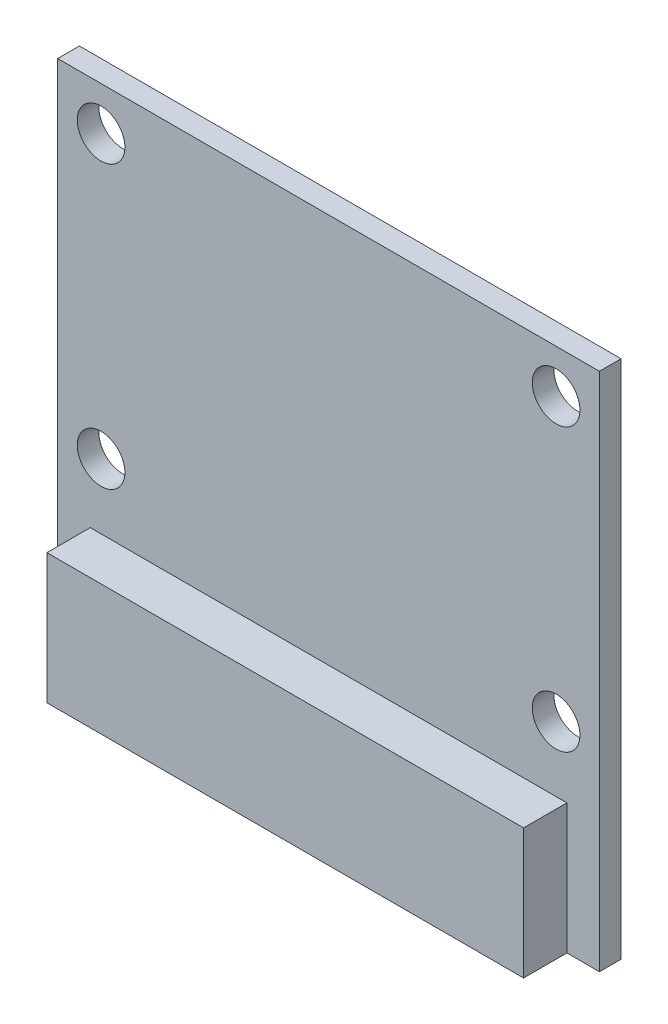
ISO-10303-21;
HEADER;
FILE_DESCRIPTION(('STEP AP214'),'2;1');
FILE_NAME('part.step','',(''),(''),'','','');
FILE_SCHEMA(('AUTOMOTIVE_DESIGN { 1 0 10303 214 1 1 1 1 }'));
ENDSEC;
DATA;
#1=APPLICATION_CONTEXT('core data for automotive mechanical design processes');
#2=APPLICATION_PROTOCOL_DEFINITION('international standard','automotive_design',2000,#1);
#3=PRODUCT_CONTEXT('',#1,'mechanical');
#4=PRODUCT('Part','Part','',(#3));
#5=PRODUCT_RELATED_PRODUCT_CATEGORY('part','',(#4));
#6=PRODUCT_DEFINITION_FORMATION('','',#4);
#7=PRODUCT_DEFINITION_CONTEXT('part definition',#1,'design');
#8=PRODUCT_DEFINITION('design','',#6,#7);
#9=PRODUCT_DEFINITION_SHAPE('','',#8);
#10=(LENGTH_UNIT() NAMED_UNIT(*) SI_UNIT(.MILLI.,.METRE.));
#11=(NAMED_UNIT(*) PLANE_ANGLE_UNIT() SI_UNIT($,.RADIAN.));
#12=(NAMED_UNIT(*) SI_UNIT($,.STERADIAN.) SOLID_ANGLE_UNIT());
#13=UNCERTAINTY_MEASURE_WITH_UNIT(LENGTH_MEASURE(1.E-05),#10,'distance_accuracy_value','');
#14=(GEOMETRIC_REPRESENTATION_CONTEXT(3) GLOBAL_UNCERTAINTY_ASSIGNED_CONTEXT((#13)) GLOBAL_UNIT_ASSIGNED_CONTEXT((#10,
#11,#12)) REPRESENTATION_CONTEXT('',''));
#15=CARTESIAN_POINT('',(0.,0.,0.));
#16=DIRECTION('',(0.,0.,1.));
#17=DIRECTION('',(1.,0.,0.));
#18=AXIS2_PLACEMENT_3D('',#15,#16,#17);
#19=CARTESIAN_POINT('',(0.,0.,0.));
#20=DIRECTION('',(0.,0.,1.));
#21=DIRECTION('',(1.,0.,0.));
#22=AXIS2_PLACEMENT_3D('',#19,#20,#21);
#23=PLANE('',#22);
#24=CARTESIAN_POINT('',(10.5,10.,0.));
#25=DIRECTION('',(0.,0.,1.));
#26=DIRECTION('',(-1.,0.,0.));
#27=AXIS2_PLACEMENT_3D('',#24,#25,#26);
#28=CIRCLE('',#27,1.1);
#29=CARTESIAN_POINT('',(9.4,10.,0.));
#30=VERTEX_POINT('',#29);
#31=EDGE_CURVE('E251',#30,#30,#28,.T.);
#32=ORIENTED_EDGE('',*,*,#31,.T.);
#33=EDGE_LOOP('',(#32));
#34=FACE_BOUND('',#33,.T.);
#35=CARTESIAN_POINT('',(10.5,-3.,0.));
#36=DIRECTION('',(0.,0.,1.));
#37=DIRECTION('',(-1.,0.,0.));
#38=AXIS2_PLACEMENT_3D('',#35,#36,#37);
#39=CIRCLE('',#38,1.1);
#40=CARTESIAN_POINT('',(9.4,-3.,0.));
#41=VERTEX_POINT('',#40);
#42=EDGE_CURVE('E255',#41,#41,#39,.T.);
#43=ORIENTED_EDGE('',*,*,#42,.T.);
#44=EDGE_LOOP('',(#43));
#45=FACE_BOUND('',#44,.T.);
#46=CARTESIAN_POINT('',(-10.5,-3.,0.));
#47=DIRECTION('',(0.,0.,1.));
#48=DIRECTION('',(1.,0.,0.));
#49=AXIS2_PLACEMENT_3D('',#46,#47,#48);
#50=CIRCLE('',#49,1.1);
#51=CARTESIAN_POINT('',(-9.4,-3.,0.));
#52=VERTEX_POINT('',#51);
#53=EDGE_CURVE('E261',#52,#52,#50,.T.);
#54=ORIENTED_EDGE('',*,*,#53,.T.);
#55=EDGE_LOOP('',(#54));
#56=FACE_BOUND('',#55,.T.);
#57=CARTESIAN_POINT('',(-10.5,10.,0.));
#58=DIRECTION('',(0.,0.,1.));
#59=DIRECTION('',(1.,0.,0.));
#60=AXIS2_PLACEMENT_3D('',#57,#58,#59);
#61=CIRCLE('',#60,1.1);
#62=CARTESIAN_POINT('',(-9.4,10.,0.));
#63=VERTEX_POINT('',#62);
#64=EDGE_CURVE('E267',#63,#63,#61,.T.);
#65=ORIENTED_EDGE('',*,*,#64,.T.);
#66=EDGE_LOOP('',(#65));
#67=FACE_BOUND('',#66,.T.);
#68=DIRECTION('',(0.,1.,0.));
#69=VECTOR('',#68,1.);
#70=CARTESIAN_POINT('',(12.5,12.,0.));
#71=LINE('',#70,#69);
#72=CARTESIAN_POINT('',(12.5,-12.,0.));
#73=VERTEX_POINT('',#72);
#74=CARTESIAN_POINT('',(12.5,12.,0.));
#75=VERTEX_POINT('',#74);
#76=EDGE_CURVE('E273',#73,#75,#71,.T.);
#77=ORIENTED_EDGE('',*,*,#76,.F.);
#78=DIRECTION('',(1.,0.,0.));
#79=VECTOR('',#78,1.);
#80=CARTESIAN_POINT('',(-12.5,-12.,0.));
#81=LINE('',#80,#79);
#82=CARTESIAN_POINT('',(-12.5,-12.,0.));
#83=VERTEX_POINT('',#82);
#84=EDGE_CURVE('E280',#83,#73,#81,.T.);
#85=ORIENTED_EDGE('',*,*,#84,.F.);
#86=DIRECTION('',(0.,-1.,0.));
#87=VECTOR('',#86,1.);
#88=CARTESIAN_POINT('',(-12.5,12.,0.));
#89=LINE('',#88,#87);
#90=CARTESIAN_POINT('',(-12.5,12.,0.));
#91=VERTEX_POINT('',#90);
#92=EDGE_CURVE('E292',#91,#83,#89,.T.);
#93=ORIENTED_EDGE('',*,*,#92,.F.);
#94=DIRECTION('',(-1.,0.,0.));
#95=VECTOR('',#94,1.);
#96=CARTESIAN_POINT('',(-12.5,12.,0.));
#97=LINE('',#96,#95);
#98=EDGE_CURVE('E290',#75,#91,#97,.T.);
#99=ORIENTED_EDGE('',*,*,#98,.F.);
#100=EDGE_LOOP('',(#77,#85,#93,#99));
#101=FACE_BOUND('',#100,.T.);
#102=DIRECTION('',(0.,-1.,0.));
#103=VECTOR('',#102,1.);
#104=CARTESIAN_POINT('',(3.5,9.,0.));
#105=LINE('',#104,#103);
#106=CARTESIAN_POINT('',(3.5,9.,0.));
#107=VERTEX_POINT('',#106);
#108=CARTESIAN_POINT('',(3.5,2.,0.));
#109=VERTEX_POINT('',#108);
#110=EDGE_CURVE('E176',#107,#109,#105,.T.);
#111=ORIENTED_EDGE('',*,*,#110,.F.);
#112=DIRECTION('',(-1.,0.,0.));
#113=VECTOR('',#112,1.);
#114=CARTESIAN_POINT('',(3.5,9.,0.));
#115=LINE('',#114,#113);
#116=CARTESIAN_POINT('',(-3.5,9.,0.));
#117=VERTEX_POINT('',#116);
#118=EDGE_CURVE('E182',#107,#117,#115,.T.);
#119=ORIENTED_EDGE('',*,*,#118,.T.);
#120=DIRECTION('',(0.,-1.,0.));
#121=VECTOR('',#120,1.);
#122=CARTESIAN_POINT('',(-3.5,9.,0.));
#123=LINE('',#122,#121);
#124=CARTESIAN_POINT('',(-3.5,2.,0.));
#125=VERTEX_POINT('',#124);
#126=EDGE_CURVE('E159',#117,#125,#123,.T.);
#127=ORIENTED_EDGE('',*,*,#126,.T.);
#128=DIRECTION('',(-1.,0.,0.));
#129=VECTOR('',#128,1.);
#130=CARTESIAN_POINT('',(0.,2.,0.));
#131=LINE('',#130,#129);
#132=CARTESIAN_POINT('',(-4.5,2.,0.));
#133=VERTEX_POINT('',#132);
#134=EDGE_CURVE('E61',#125,#133,#131,.T.);
#135=ORIENTED_EDGE('',*,*,#134,.T.);
#136=DIRECTION('',(0.,-1.,0.));
#137=VECTOR('',#136,1.);
#138=CARTESIAN_POINT('',(-4.5,0.,0.));
#139=LINE('',#138,#137);
#140=CARTESIAN_POINT('',(-4.5,-7.,0.));
#141=VERTEX_POINT('',#140);
#142=EDGE_CURVE('E190',#133,#141,#139,.T.);
#143=ORIENTED_EDGE('',*,*,#142,.T.);
#144=DIRECTION('',(-1.,0.,0.));
#145=VECTOR('',#144,1.);
#146=CARTESIAN_POINT('',(0.,-7.,0.));
#147=LINE('',#146,#145);
#148=CARTESIAN_POINT('',(4.5,-7.,0.));
#149=VERTEX_POINT('',#148);
#150=EDGE_CURVE('E196',#149,#141,#147,.T.);
#151=ORIENTED_EDGE('',*,*,#150,.F.);
#152=DIRECTION('',(0.,-1.,0.));
#153=VECTOR('',#152,1.);
#154=CARTESIAN_POINT('',(4.5,0.,0.));
#155=LINE('',#154,#153);
#156=CARTESIAN_POINT('',(4.5,2.,0.));
#157=VERTEX_POINT('',#156);
#158=EDGE_CURVE('E208',#157,#149,#155,.T.);
#159=ORIENTED_EDGE('',*,*,#158,.F.);
#160=EDGE_CURVE('E205',#157,#109,#131,.T.);
#161=ORIENTED_EDGE('',*,*,#160,.T.);
#162=EDGE_LOOP('',(#111,#119,#127,#135,#143,#151,#159,#161));
#163=FACE_BOUND('',#162,.T.);
#164=ADVANCED_FACE('F37',(#34,#45,#56,#67,#101,#163),#23,.F.);
#165=CARTESIAN_POINT('',(0.,2.,-2.5));
#166=DIRECTION('',(0.,1.,0.));
#167=DIRECTION('',(0.,0.,1.));
#168=AXIS2_PLACEMENT_3D('',#165,#166,#167);
#169=PLANE('',#168);
#170=DIRECTION('',(-1.,0.,0.));
#171=VECTOR('',#170,1.);
#172=CARTESIAN_POINT('',(3.5,2.,-1.));
#173=LINE('',#172,#171);
#174=CARTESIAN_POINT('',(3.5,2.,-1.));
#175=VERTEX_POINT('',#174);
#176=CARTESIAN_POINT('',(-3.5,2.,-1.));
#177=VERTEX_POINT('',#176);
#178=EDGE_CURVE('E172',#175,#177,#173,.T.);
#179=ORIENTED_EDGE('',*,*,#178,.F.);
#180=DIRECTION('',(0.,0.,1.));
#181=VECTOR('',#180,1.);
#182=CARTESIAN_POINT('',(3.5,2.,-1.));
#183=LINE('',#182,#181);
#184=EDGE_CURVE('E53',#175,#109,#183,.T.);
#185=ORIENTED_EDGE('',*,*,#184,.T.);
#186=ORIENTED_EDGE('',*,*,#160,.F.);
#187=DIRECTION('',(0.,0.,1.));
#188=VECTOR('',#187,1.);
#189=CARTESIAN_POINT('',(4.5,2.,-2.5));
#190=LINE('',#189,#188);
#191=CARTESIAN_POINT('',(4.5,2.,-2.5));
#192=VERTEX_POINT('',#191);
#193=EDGE_CURVE('E216',#192,#157,#190,.T.);
#194=ORIENTED_EDGE('',*,*,#193,.F.);
#195=DIRECTION('',(-1.,0.,0.));
#196=VECTOR('',#195,1.);
#197=CARTESIAN_POINT('',(0.,2.,-2.5));
#198=LINE('',#197,#196);
#199=CARTESIAN_POINT('',(-4.5,2.,-2.5));
#200=VERTEX_POINT('',#199);
#201=EDGE_CURVE('E195',#192,#200,#198,.T.);
#202=ORIENTED_EDGE('',*,*,#201,.T.);
#203=DIRECTION('',(0.,0.,1.));
#204=VECTOR('',#203,1.);
#205=CARTESIAN_POINT('',(-4.5,2.,-2.5));
#206=LINE('',#205,#204);
#207=EDGE_CURVE('E218',#200,#133,#206,.T.);
#208=ORIENTED_EDGE('',*,*,#207,.T.);
#209=ORIENTED_EDGE('',*,*,#134,.F.);
#210=DIRECTION('',(0.,0.,1.));
#211=VECTOR('',#210,1.);
#212=CARTESIAN_POINT('',(-3.5,2.,-1.));
#213=LINE('',#212,#211);
#214=EDGE_CURVE('E164',#177,#125,#213,.T.);
#215=ORIENTED_EDGE('',*,*,#214,.F.);
#216=EDGE_LOOP('',(#179,#185,#186,#194,#202,#208,#209,#215));
#217=FACE_BOUND('',#216,.T.);
#218=ADVANCED_FACE('F348',(#217),#169,.T.);
#219=CARTESIAN_POINT('',(0.,0.,1.));
#220=DIRECTION('',(0.,0.,1.));
#221=DIRECTION('',(1.,0.,0.));
#222=AXIS2_PLACEMENT_3D('',#219,#220,#221);
#223=PLANE('',#222);
#224=CARTESIAN_POINT('',(10.5,-3.,1.));
#225=DIRECTION('',(0.,0.,1.));
#226=DIRECTION('',(-1.,0.,0.));
#227=AXIS2_PLACEMENT_3D('',#224,#225,#226);
#228=CIRCLE('',#227,1.1);
#229=CARTESIAN_POINT('',(9.4,-3.,1.));
#230=VERTEX_POINT('',#229);
#231=EDGE_CURVE('E258',#230,#230,#228,.T.);
#232=ORIENTED_EDGE('',*,*,#231,.F.);
#233=EDGE_LOOP('',(#232));
#234=FACE_BOUND('',#233,.T.);
#235=CARTESIAN_POINT('',(-10.5,10.,1.));
#236=DIRECTION('',(0.,0.,1.));
#237=DIRECTION('',(1.,0.,0.));
#238=AXIS2_PLACEMENT_3D('',#235,#236,#237);
#239=CIRCLE('',#238,1.1);
#240=CARTESIAN_POINT('',(-9.4,10.,1.));
#241=VERTEX_POINT('',#240);
#242=EDGE_CURVE('E270',#241,#241,#239,.T.);
#243=ORIENTED_EDGE('',*,*,#242,.F.);
#244=EDGE_LOOP('',(#243));
#245=FACE_BOUND('',#244,.T.);
#246=CARTESIAN_POINT('',(-10.5,-3.,1.));
#247=DIRECTION('',(0.,0.,1.));
#248=DIRECTION('',(1.,0.,0.));
#249=AXIS2_PLACEMENT_3D('',#246,#247,#248);
#250=CIRCLE('',#249,1.1);
#251=CARTESIAN_POINT('',(-9.4,-3.,1.));
#252=VERTEX_POINT('',#251);
#253=EDGE_CURVE('E264',#252,#252,#250,.T.);
#254=ORIENTED_EDGE('',*,*,#253,.F.);
#255=EDGE_LOOP('',(#254));
#256=FACE_BOUND('',#255,.T.);
#257=CARTESIAN_POINT('',(10.5,10.,1.));
#258=DIRECTION('',(0.,0.,1.));
#259=DIRECTION('',(-1.,0.,0.));
#260=AXIS2_PLACEMENT_3D('',#257,#258,#259);
#261=CIRCLE('',#260,1.1);
#262=CARTESIAN_POINT('',(9.4,10.,1.));
#263=VERTEX_POINT('',#262);
#264=EDGE_CURVE('E252',#263,#263,#261,.T.);
#265=ORIENTED_EDGE('',*,*,#264,.F.);
#266=EDGE_LOOP('',(#265));
#267=FACE_BOUND('',#266,.T.);
#268=DIRECTION('',(1.,0.,0.));
#269=VECTOR('',#268,1.);
#270=CARTESIAN_POINT('',(-12.5,-12.,1.));
#271=LINE('',#270,#269);
#272=CARTESIAN_POINT('',(-12.5,-12.,1.));
#273=VERTEX_POINT('',#272);
#274=CARTESIAN_POINT('',(-11.,-12.,1.));
#275=VERTEX_POINT('',#274);
#276=EDGE_CURVE('E285',#273,#275,#271,.T.);
#277=ORIENTED_EDGE('',*,*,#276,.T.);
#278=DIRECTION('',(0.,1.,0.));
#279=VECTOR('',#278,1.);
#280=CARTESIAN_POINT('',(-11.,0.,1.));
#281=LINE('',#280,#279);
#282=CARTESIAN_POINT('',(-11.,-6.,1.));
#283=VERTEX_POINT('',#282);
#284=EDGE_CURVE('E226',#275,#283,#281,.T.);
#285=ORIENTED_EDGE('',*,*,#284,.T.);
#286=DIRECTION('',(1.,0.,0.));
#287=VECTOR('',#286,1.);
#288=CARTESIAN_POINT('',(0.,-6.,1.));
#289=LINE('',#288,#287);
#290=CARTESIAN_POINT('',(11.,-6.,1.));
#291=VERTEX_POINT('',#290);
#292=EDGE_CURVE('E237',#283,#291,#289,.T.);
#293=ORIENTED_EDGE('',*,*,#292,.T.);
#294=DIRECTION('',(0.,1.,0.));
#295=VECTOR('',#294,1.);
#296=CARTESIAN_POINT('',(11.,0.,1.));
#297=LINE('',#296,#295);
#298=CARTESIAN_POINT('',(11.,-12.,1.));
#299=VERTEX_POINT('',#298);
#300=EDGE_CURVE('E221',#299,#291,#297,.T.);
#301=ORIENTED_EDGE('',*,*,#300,.F.);
#302=CARTESIAN_POINT('',(12.5,-12.,1.));
#303=VERTEX_POINT('',#302);
#304=EDGE_CURVE('E284',#299,#303,#271,.T.);
#305=ORIENTED_EDGE('',*,*,#304,.T.);
#306=DIRECTION('',(0.,1.,0.));
#307=VECTOR('',#306,1.);
#308=CARTESIAN_POINT('',(12.5,12.,1.));
#309=LINE('',#308,#307);
#310=CARTESIAN_POINT('',(12.5,12.,1.));
#311=VERTEX_POINT('',#310);
#312=EDGE_CURVE('E276',#303,#311,#309,.T.);
#313=ORIENTED_EDGE('',*,*,#312,.T.);
#314=DIRECTION('',(-1.,0.,0.));
#315=VECTOR('',#314,1.);
#316=CARTESIAN_POINT('',(-12.5,12.,1.));
#317=LINE('',#316,#315);
#318=CARTESIAN_POINT('',(-12.5,12.,1.));
#319=VERTEX_POINT('',#318);
#320=EDGE_CURVE('E279',#311,#319,#317,.T.);
#321=ORIENTED_EDGE('',*,*,#320,.T.);
#322=DIRECTION('',(0.,-1.,0.));
#323=VECTOR('',#322,1.);
#324=CARTESIAN_POINT('',(-12.5,12.,1.));
#325=LINE('',#324,#323);
#326=EDGE_CURVE('E282',#319,#273,#325,.T.);
#327=ORIENTED_EDGE('',*,*,#326,.T.);
#328=EDGE_LOOP('',(#277,#285,#293,#301,#305,#313,#321,#327));
#329=FACE_BOUND('',#328,.T.);
#330=ADVANCED_FACE('F323',(#234,#245,#256,#267,#329),#223,.T.);
#331=CARTESIAN_POINT('',(12.5,12.,1.));
#332=DIRECTION('',(-1.,0.,0.));
#333=DIRECTION('',(0.,-1.,0.));
#334=AXIS2_PLACEMENT_3D('',#331,#332,#333);
#335=PLANE('',#334);
#336=ORIENTED_EDGE('',*,*,#76,.T.);
#337=DIRECTION('',(0.,0.,-1.));
#338=VECTOR('',#337,1.);
#339=CARTESIAN_POINT('',(12.5,12.,1.));
#340=LINE('',#339,#338);
#341=EDGE_CURVE('E41',#311,#75,#340,.T.);
#342=ORIENTED_EDGE('',*,*,#341,.F.);
#343=ORIENTED_EDGE('',*,*,#312,.F.);
#344=DIRECTION('',(0.,0.,-1.));
#345=VECTOR('',#344,1.);
#346=CARTESIAN_POINT('',(12.5,-12.,1.));
#347=LINE('',#346,#345);
#348=EDGE_CURVE('E287',#303,#73,#347,.T.);
#349=ORIENTED_EDGE('',*,*,#348,.T.);
#350=EDGE_LOOP('',(#336,#342,#343,#349));
#351=FACE_BOUND('',#350,.T.);
#352=ADVANCED_FACE('F39',(#351),#335,.F.);
#353=CARTESIAN_POINT('',(-12.5,12.,1.));
#354=DIRECTION('',(0.,-1.,0.));
#355=DIRECTION('',(0.,0.,-1.));
#356=AXIS2_PLACEMENT_3D('',#353,#354,#355);
#357=PLANE('',#356);
#358=ORIENTED_EDGE('',*,*,#98,.T.);
#359=DIRECTION('',(0.,0.,-1.));
#360=VECTOR('',#359,1.);
#361=CARTESIAN_POINT('',(-12.5,12.,1.));
#362=LINE('',#361,#360);
#363=EDGE_CURVE('E299',#319,#91,#362,.T.);
#364=ORIENTED_EDGE('',*,*,#363,.F.);
#365=ORIENTED_EDGE('',*,*,#320,.F.);
#366=ORIENTED_EDGE('',*,*,#341,.T.);
#367=EDGE_LOOP('',(#358,#364,#365,#366));
#368=FACE_BOUND('',#367,.T.);
#369=ADVANCED_FACE('F308',(#368),#357,.F.);
#370=CARTESIAN_POINT('',(-12.5,12.,1.));
#371=DIRECTION('',(1.,0.,0.));
#372=DIRECTION('',(0.,1.,0.));
#373=AXIS2_PLACEMENT_3D('',#370,#371,#372);
#374=PLANE('',#373);
#375=ORIENTED_EDGE('',*,*,#92,.T.);
#376=DIRECTION('',(0.,0.,-1.));
#377=VECTOR('',#376,1.);
#378=CARTESIAN_POINT('',(-12.5,-12.,1.));
#379=LINE('',#378,#377);
#380=EDGE_CURVE('E297',#273,#83,#379,.T.);
#381=ORIENTED_EDGE('',*,*,#380,.F.);
#382=ORIENTED_EDGE('',*,*,#326,.F.);
#383=ORIENTED_EDGE('',*,*,#363,.T.);
#384=EDGE_LOOP('',(#375,#381,#382,#383));
#385=FACE_BOUND('',#384,.T.);
#386=ADVANCED_FACE('F316',(#385),#374,.F.);
#387=CARTESIAN_POINT('',(-12.5,-12.,1.));
#388=DIRECTION('',(0.,1.,0.));
#389=DIRECTION('',(0.,0.,1.));
#390=AXIS2_PLACEMENT_3D('',#387,#388,#389);
#391=PLANE('',#390);
#392=ORIENTED_EDGE('',*,*,#84,.T.);
#393=ORIENTED_EDGE('',*,*,#348,.F.);
#394=ORIENTED_EDGE('',*,*,#304,.F.);
#395=DIRECTION('',(0.,0.,-1.));
#396=VECTOR('',#395,1.);
#397=CARTESIAN_POINT('',(11.,-12.,3.));
#398=LINE('',#397,#396);
#399=CARTESIAN_POINT('',(11.,-12.,3.));
#400=VERTEX_POINT('',#399);
#401=EDGE_CURVE('E248',#400,#299,#398,.T.);
#402=ORIENTED_EDGE('',*,*,#401,.F.);
#403=DIRECTION('',(1.,0.,0.));
#404=VECTOR('',#403,1.);
#405=CARTESIAN_POINT('',(0.,-12.,3.));
#406=LINE('',#405,#404);
#407=CARTESIAN_POINT('',(-11.,-12.,3.));
#408=VERTEX_POINT('',#407);
#409=EDGE_CURVE('E222',#408,#400,#406,.T.);
#410=ORIENTED_EDGE('',*,*,#409,.F.);
#411=DIRECTION('',(0.,0.,-1.));
#412=VECTOR('',#411,1.);
#413=CARTESIAN_POINT('',(-11.,-12.,3.));
#414=LINE('',#413,#412);
#415=EDGE_CURVE('E234',#408,#275,#414,.T.);
#416=ORIENTED_EDGE('',*,*,#415,.T.);
#417=ORIENTED_EDGE('',*,*,#276,.F.);
#418=ORIENTED_EDGE('',*,*,#380,.T.);
#419=EDGE_LOOP('',(#392,#393,#394,#402,#410,#416,#417,#418));
#420=FACE_BOUND('',#419,.T.);
#421=ADVANCED_FACE('F319',(#420),#391,.F.);
#422=CARTESIAN_POINT('',(-10.5,10.,1.));
#423=DIRECTION('',(0.,0.,-1.));
#424=DIRECTION('',(-1.,0.,0.));
#425=AXIS2_PLACEMENT_3D('',#422,#423,#424);
#426=CYLINDRICAL_SURFACE('',#425,1.1);
#427=ORIENTED_EDGE('',*,*,#242,.T.);
#428=EDGE_LOOP('',(#427));
#429=FACE_BOUND('',#428,.T.);
#430=ORIENTED_EDGE('',*,*,#64,.F.);
#431=EDGE_LOOP('',(#430));
#432=FACE_BOUND('',#431,.T.);
#433=ADVANCED_FACE('F362',(#429,#432),#426,.F.);
#434=CARTESIAN_POINT('',(-10.5,-3.,1.));
#435=DIRECTION('',(0.,0.,-1.));
#436=DIRECTION('',(-1.,0.,0.));
#437=AXIS2_PLACEMENT_3D('',#434,#435,#436);
#438=CYLINDRICAL_SURFACE('',#437,1.1);
#439=ORIENTED_EDGE('',*,*,#253,.T.);
#440=EDGE_LOOP('',(#439));
#441=FACE_BOUND('',#440,.T.);
#442=ORIENTED_EDGE('',*,*,#53,.F.);
#443=EDGE_LOOP('',(#442));
#444=FACE_BOUND('',#443,.T.);
#445=ADVANCED_FACE('F390',(#441,#444),#438,.F.);
#446=CARTESIAN_POINT('',(10.5,-3.,1.));
#447=DIRECTION('',(0.,0.,-1.));
#448=DIRECTION('',(-1.,0.,0.));
#449=AXIS2_PLACEMENT_3D('',#446,#447,#448);
#450=CYLINDRICAL_SURFACE('',#449,1.1);
#451=ORIENTED_EDGE('',*,*,#231,.T.);
#452=EDGE_LOOP('',(#451));
#453=FACE_BOUND('',#452,.T.);
#454=ORIENTED_EDGE('',*,*,#42,.F.);
#455=EDGE_LOOP('',(#454));
#456=FACE_BOUND('',#455,.T.);
#457=ADVANCED_FACE('F384',(#453,#456),#450,.F.);
#458=CARTESIAN_POINT('',(10.5,10.,1.));
#459=DIRECTION('',(0.,0.,-1.));
#460=DIRECTION('',(-1.,0.,0.));
#461=AXIS2_PLACEMENT_3D('',#458,#459,#460);
#462=CYLINDRICAL_SURFACE('',#461,1.1);
#463=ORIENTED_EDGE('',*,*,#264,.T.);
#464=EDGE_LOOP('',(#463));
#465=FACE_BOUND('',#464,.T.);
#466=ORIENTED_EDGE('',*,*,#31,.F.);
#467=EDGE_LOOP('',(#466));
#468=FACE_BOUND('',#467,.T.);
#469=ADVANCED_FACE('F345',(#465,#468),#462,.F.);
#470=CARTESIAN_POINT('',(11.,0.,3.));
#471=DIRECTION('',(-1.,0.,0.));
#472=DIRECTION('',(0.,0.,1.));
#473=AXIS2_PLACEMENT_3D('',#470,#471,#472);
#474=PLANE('',#473);
#475=ORIENTED_EDGE('',*,*,#300,.T.);
#476=DIRECTION('',(0.,0.,-1.));
#477=VECTOR('',#476,1.);
#478=CARTESIAN_POINT('',(11.,-6.,3.));
#479=LINE('',#478,#477);
#480=CARTESIAN_POINT('',(11.,-6.,3.));
#481=VERTEX_POINT('',#480);
#482=EDGE_CURVE('E245',#481,#291,#479,.T.);
#483=ORIENTED_EDGE('',*,*,#482,.F.);
#484=DIRECTION('',(0.,1.,0.));
#485=VECTOR('',#484,1.);
#486=CARTESIAN_POINT('',(11.,0.,3.));
#487=LINE('',#486,#485);
#488=EDGE_CURVE('E225',#400,#481,#487,.T.);
#489=ORIENTED_EDGE('',*,*,#488,.F.);
#490=ORIENTED_EDGE('',*,*,#401,.T.);
#491=EDGE_LOOP('',(#475,#483,#489,#490));
#492=FACE_BOUND('',#491,.T.);
#493=ADVANCED_FACE('F327',(#492),#474,.F.);
#494=CARTESIAN_POINT('',(0.,-6.,3.));
#495=DIRECTION('',(0.,1.,0.));
#496=DIRECTION('',(0.,0.,1.));
#497=AXIS2_PLACEMENT_3D('',#494,#495,#496);
#498=PLANE('',#497);
#499=ORIENTED_EDGE('',*,*,#292,.F.);
#500=DIRECTION('',(0.,0.,-1.));
#501=VECTOR('',#500,1.);
#502=CARTESIAN_POINT('',(-11.,-6.,3.));
#503=LINE('',#502,#501);
#504=CARTESIAN_POINT('',(-11.,-6.,3.));
#505=VERTEX_POINT('',#504);
#506=EDGE_CURVE('E242',#505,#283,#503,.T.);
#507=ORIENTED_EDGE('',*,*,#506,.F.);
#508=DIRECTION('',(1.,0.,0.));
#509=VECTOR('',#508,1.);
#510=CARTESIAN_POINT('',(0.,-6.,3.));
#511=LINE('',#510,#509);
#512=EDGE_CURVE('E228',#505,#481,#511,.T.);
#513=ORIENTED_EDGE('',*,*,#512,.T.);
#514=ORIENTED_EDGE('',*,*,#482,.T.);
#515=EDGE_LOOP('',(#499,#507,#513,#514));
#516=FACE_BOUND('',#515,.T.);
#517=ADVANCED_FACE('F337',(#516),#498,.T.);
#518=CARTESIAN_POINT('',(-11.,0.,3.));
#519=DIRECTION('',(-1.,0.,0.));
#520=DIRECTION('',(0.,0.,1.));
#521=AXIS2_PLACEMENT_3D('',#518,#519,#520);
#522=PLANE('',#521);
#523=ORIENTED_EDGE('',*,*,#284,.F.);
#524=ORIENTED_EDGE('',*,*,#415,.F.);
#525=DIRECTION('',(0.,1.,0.));
#526=VECTOR('',#525,1.);
#527=CARTESIAN_POINT('',(-11.,0.,3.));
#528=LINE('',#527,#526);
#529=EDGE_CURVE('E231',#408,#505,#528,.T.);
#530=ORIENTED_EDGE('',*,*,#529,.T.);
#531=ORIENTED_EDGE('',*,*,#506,.T.);
#532=EDGE_LOOP('',(#523,#524,#530,#531));
#533=FACE_BOUND('',#532,.T.);
#534=ADVANCED_FACE('F334',(#533),#522,.T.);
#535=CARTESIAN_POINT('',(0.,0.,3.));
#536=DIRECTION('',(0.,0.,1.));
#537=DIRECTION('',(1.,0.,0.));
#538=AXIS2_PLACEMENT_3D('',#535,#536,#537);
#539=PLANE('',#538);
#540=ORIENTED_EDGE('',*,*,#409,.T.);
#541=ORIENTED_EDGE('',*,*,#488,.T.);
#542=ORIENTED_EDGE('',*,*,#512,.F.);
#543=ORIENTED_EDGE('',*,*,#529,.F.);
#544=EDGE_LOOP('',(#540,#541,#542,#543));
#545=FACE_BOUND('',#544,.T.);
#546=ADVANCED_FACE('F332',(#545),#539,.T.);
#547=CARTESIAN_POINT('',(-4.5,0.,-2.5));
#548=DIRECTION('',(-1.,0.,0.));
#549=DIRECTION('',(0.,-1.,0.));
#550=AXIS2_PLACEMENT_3D('',#547,#548,#549);
#551=PLANE('',#550);
#552=ORIENTED_EDGE('',*,*,#142,.F.);
#553=ORIENTED_EDGE('',*,*,#207,.F.);
#554=DIRECTION('',(0.,-1.,0.));
#555=VECTOR('',#554,1.);
#556=CARTESIAN_POINT('',(-4.5,0.,-2.5));
#557=LINE('',#556,#555);
#558=CARTESIAN_POINT('',(-4.5,-7.,-2.5));
#559=VERTEX_POINT('',#558);
#560=EDGE_CURVE('E192',#200,#559,#557,.T.);
#561=ORIENTED_EDGE('',*,*,#560,.T.);
#562=DIRECTION('',(0.,0.,1.));
#563=VECTOR('',#562,1.);
#564=CARTESIAN_POINT('',(-4.5,-7.,-2.5));
#565=LINE('',#564,#563);
#566=EDGE_CURVE('E203',#559,#141,#565,.T.);
#567=ORIENTED_EDGE('',*,*,#566,.T.);
#568=EDGE_LOOP('',(#552,#553,#561,#567));
#569=FACE_BOUND('',#568,.T.);
#570=ADVANCED_FACE('F453',(#569),#551,.T.);
#571=CARTESIAN_POINT('',(4.5,0.,-2.5));
#572=DIRECTION('',(-1.,0.,0.));
#573=DIRECTION('',(0.,-1.,0.));
#574=AXIS2_PLACEMENT_3D('',#571,#572,#573);
#575=PLANE('',#574);
#576=ORIENTED_EDGE('',*,*,#158,.T.);
#577=DIRECTION('',(0.,0.,1.));
#578=VECTOR('',#577,1.);
#579=CARTESIAN_POINT('',(4.5,-7.,-2.5));
#580=LINE('',#579,#578);
#581=CARTESIAN_POINT('',(4.5,-7.,-2.5));
#582=VERTEX_POINT('',#581);
#583=EDGE_CURVE('E213',#582,#149,#580,.T.);
#584=ORIENTED_EDGE('',*,*,#583,.F.);
#585=DIRECTION('',(0.,-1.,0.));
#586=VECTOR('',#585,1.);
#587=CARTESIAN_POINT('',(4.5,0.,-2.5));
#588=LINE('',#587,#586);
#589=EDGE_CURVE('E199',#192,#582,#588,.T.);
#590=ORIENTED_EDGE('',*,*,#589,.F.);
#591=ORIENTED_EDGE('',*,*,#193,.T.);
#592=EDGE_LOOP('',(#576,#584,#590,#591));
#593=FACE_BOUND('',#592,.T.);
#594=ADVANCED_FACE('F462',(#593),#575,.F.);
#595=CARTESIAN_POINT('',(0.,-7.,-2.5));
#596=DIRECTION('',(0.,1.,0.));
#597=DIRECTION('',(0.,0.,1.));
#598=AXIS2_PLACEMENT_3D('',#595,#596,#597);
#599=PLANE('',#598);
#600=ORIENTED_EDGE('',*,*,#150,.T.);
#601=ORIENTED_EDGE('',*,*,#566,.F.);
#602=DIRECTION('',(-1.,0.,0.));
#603=VECTOR('',#602,1.);
#604=CARTESIAN_POINT('',(0.,-7.,-2.5));
#605=LINE('',#604,#603);
#606=EDGE_CURVE('E201',#582,#559,#605,.T.);
#607=ORIENTED_EDGE('',*,*,#606,.F.);
#608=ORIENTED_EDGE('',*,*,#583,.T.);
#609=EDGE_LOOP('',(#600,#601,#607,#608));
#610=FACE_BOUND('',#609,.T.);
#611=ADVANCED_FACE('F472',(#610),#599,.F.);
#612=CARTESIAN_POINT('',(0.,0.,-2.5));
#613=DIRECTION('',(0.,0.,-1.));
#614=DIRECTION('',(-1.,0.,0.));
#615=AXIS2_PLACEMENT_3D('',#612,#613,#614);
#616=PLANE('',#615);
#617=CARTESIAN_POINT('',(0.,-2.5,-2.5));
#618=DIRECTION('',(0.,0.,-1.));
#619=DIRECTION('',(-1.,0.,0.));
#620=AXIS2_PLACEMENT_3D('',#617,#618,#619);
#621=CIRCLE('',#620,3.5);
#622=CARTESIAN_POINT('',(-3.5,-2.5,-2.5));
#623=VERTEX_POINT('',#622);
#624=EDGE_CURVE('E11',#623,#623,#621,.T.);
#625=ORIENTED_EDGE('',*,*,#624,.F.);
#626=EDGE_LOOP('',(#625));
#627=FACE_BOUND('',#626,.T.);
#628=ORIENTED_EDGE('',*,*,#560,.F.);
#629=ORIENTED_EDGE('',*,*,#201,.F.);
#630=ORIENTED_EDGE('',*,*,#589,.T.);
#631=ORIENTED_EDGE('',*,*,#606,.T.);
#632=EDGE_LOOP('',(#628,#629,#630,#631));
#633=FACE_BOUND('',#632,.T.);
#634=ADVANCED_FACE('F482',(#627,#633),#616,.T.);
#635=CARTESIAN_POINT('',(0.,-2.5,-4.));
#636=DIRECTION('',(0.,0.,1.));
#637=DIRECTION('',(1.,0.,0.));
#638=AXIS2_PLACEMENT_3D('',#635,#636,#637);
#639=CYLINDRICAL_SURFACE('',#638,3.5);
#640=CARTESIAN_POINT('',(0.,-2.5,-4.));
#641=DIRECTION('',(0.,0.,-1.));
#642=DIRECTION('',(-1.,0.,0.));
#643=AXIS2_PLACEMENT_3D('',#640,#641,#642);
#644=CIRCLE('',#643,3.5);
#645=CARTESIAN_POINT('',(-3.5,-2.5,-4.));
#646=VERTEX_POINT('',#645);
#647=EDGE_CURVE('E186',#646,#646,#644,.T.);
#648=ORIENTED_EDGE('',*,*,#647,.F.);
#649=EDGE_LOOP('',(#648));
#650=FACE_BOUND('',#649,.T.);
#651=ORIENTED_EDGE('',*,*,#624,.T.);
#652=EDGE_LOOP('',(#651));
#653=FACE_BOUND('',#652,.T.);
#654=ADVANCED_FACE('F492',(#650,#653),#639,.T.);
#655=CARTESIAN_POINT('',(0.,-2.5,-4.));
#656=DIRECTION('',(0.,0.,-1.));
#657=DIRECTION('',(-1.,0.,0.));
#658=AXIS2_PLACEMENT_3D('',#655,#656,#657);
#659=PLANE('',#658);
#660=ORIENTED_EDGE('',*,*,#647,.T.);
#661=EDGE_LOOP('',(#660));
#662=FACE_BOUND('',#661,.T.);
#663=ADVANCED_FACE('F502',(#662),#659,.T.);
#664=CARTESIAN_POINT('',(3.5,9.,-1.));
#665=DIRECTION('',(0.,1.,0.));
#666=DIRECTION('',(0.,0.,1.));
#667=AXIS2_PLACEMENT_3D('',#664,#665,#666);
#668=PLANE('',#667);
#669=ORIENTED_EDGE('',*,*,#118,.F.);
#670=DIRECTION('',(0.,0.,1.));
#671=VECTOR('',#670,1.);
#672=CARTESIAN_POINT('',(3.5,9.,-1.));
#673=LINE('',#672,#671);
#674=CARTESIAN_POINT('',(3.5,9.,-1.));
#675=VERTEX_POINT('',#674);
#676=EDGE_CURVE('E175',#675,#107,#673,.T.);
#677=ORIENTED_EDGE('',*,*,#676,.F.);
#678=DIRECTION('',(-1.,0.,0.));
#679=VECTOR('',#678,1.);
#680=CARTESIAN_POINT('',(3.5,9.,-1.));
#681=LINE('',#680,#679);
#682=CARTESIAN_POINT('',(-3.5,9.,-1.));
#683=VERTEX_POINT('',#682);
#684=EDGE_CURVE('E170',#675,#683,#681,.T.);
#685=ORIENTED_EDGE('',*,*,#684,.T.);
#686=DIRECTION('',(0.,0.,1.));
#687=VECTOR('',#686,1.);
#688=CARTESIAN_POINT('',(-3.5,9.,-1.));
#689=LINE('',#688,#687);
#690=EDGE_CURVE('E154',#683,#117,#689,.T.);
#691=ORIENTED_EDGE('',*,*,#690,.T.);
#692=EDGE_LOOP('',(#669,#677,#685,#691));
#693=FACE_BOUND('',#692,.T.);
#694=ADVANCED_FACE('F174',(#693),#668,.T.);
#695=CARTESIAN_POINT('',(3.5,9.,-1.));
#696=DIRECTION('',(-1.,0.,0.));
#697=DIRECTION('',(0.,-1.,0.));
#698=AXIS2_PLACEMENT_3D('',#695,#696,#697);
#699=PLANE('',#698);
#700=ORIENTED_EDGE('',*,*,#110,.T.);
#701=ORIENTED_EDGE('',*,*,#184,.F.);
#702=DIRECTION('',(0.,-1.,0.));
#703=VECTOR('',#702,1.);
#704=CARTESIAN_POINT('',(3.5,9.,-1.));
#705=LINE('',#704,#703);
#706=EDGE_CURVE('E165',#675,#175,#705,.T.);
#707=ORIENTED_EDGE('',*,*,#706,.F.);
#708=ORIENTED_EDGE('',*,*,#676,.T.);
#709=EDGE_LOOP('',(#700,#701,#707,#708));
#710=FACE_BOUND('',#709,.T.);
#711=ADVANCED_FACE('F531',(#710),#699,.F.);
#712=CARTESIAN_POINT('',(-3.5,9.,-1.));
#713=DIRECTION('',(-1.,0.,0.));
#714=DIRECTION('',(0.,-1.,0.));
#715=AXIS2_PLACEMENT_3D('',#712,#713,#714);
#716=PLANE('',#715);
#717=ORIENTED_EDGE('',*,*,#126,.F.);
#718=ORIENTED_EDGE('',*,*,#690,.F.);
#719=DIRECTION('',(0.,-1.,0.));
#720=VECTOR('',#719,1.);
#721=CARTESIAN_POINT('',(-3.5,9.,-1.));
#722=LINE('',#721,#720);
#723=EDGE_CURVE('E157',#683,#177,#722,.T.);
#724=ORIENTED_EDGE('',*,*,#723,.T.);
#725=ORIENTED_EDGE('',*,*,#214,.T.);
#726=EDGE_LOOP('',(#717,#718,#724,#725));
#727=FACE_BOUND('',#726,.T.);
#728=ADVANCED_FACE('F156',(#727),#716,.T.);
#729=CARTESIAN_POINT('',(0.,0.,-1.));
#730=DIRECTION('',(0.,0.,1.));
#731=DIRECTION('',(1.,0.,0.));
#732=AXIS2_PLACEMENT_3D('',#729,#730,#731);
#733=PLANE('',#732);
#734=ORIENTED_EDGE('',*,*,#684,.F.);
#735=ORIENTED_EDGE('',*,*,#706,.T.);
#736=ORIENTED_EDGE('',*,*,#178,.T.);
#737=ORIENTED_EDGE('',*,*,#723,.F.);
#738=EDGE_LOOP('',(#734,#735,#736,#737));
#739=FACE_BOUND('',#738,.T.);
#740=ADVANCED_FACE('F169',(#739),#733,.F.);
#741=CLOSED_SHELL('',(#164,#218,#330,#352,#369,#386,#421,#433,#445,#457,#469,#493,#517,#534,
#546,#570,#594,#611,#634,#654,#663,#694,#711,#728,#740));
#742=MANIFOLD_SOLID_BREP('B2',#741);
#743=ADVANCED_BREP_SHAPE_REPRESENTATION('',(#18,#742),#14);
#744=SHAPE_DEFINITION_REPRESENTATION(#9,#743);
ENDSEC;
END-ISO-10303-21;
